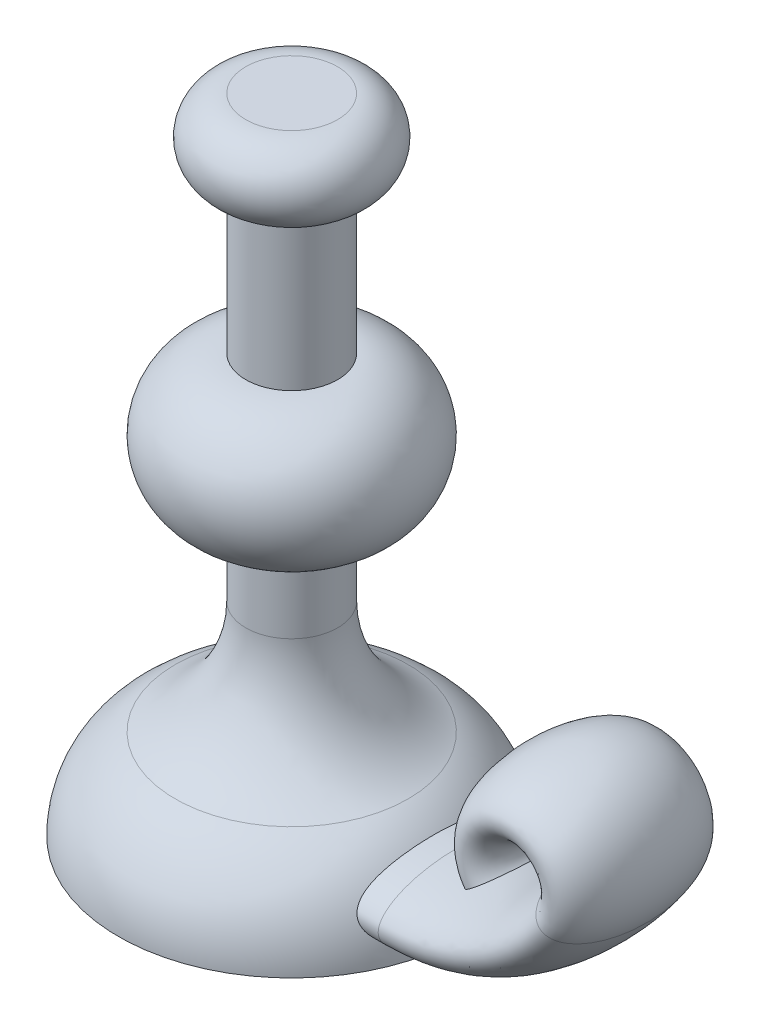
ISO-10303-21;
HEADER;
FILE_DESCRIPTION(('STEP AP214'),'2;1');
FILE_NAME('part.step','',(''),(''),'','','');
FILE_SCHEMA(('AUTOMOTIVE_DESIGN { 1 0 10303 214 1 1 1 1 }'));
ENDSEC;
DATA;
#1=APPLICATION_CONTEXT('core data for automotive mechanical design processes');
#2=APPLICATION_PROTOCOL_DEFINITION('international standard','automotive_design',2000,#1);
#3=PRODUCT_CONTEXT('',#1,'mechanical');
#4=PRODUCT('Part','Part','',(#3));
#5=PRODUCT_RELATED_PRODUCT_CATEGORY('part','',(#4));
#6=PRODUCT_DEFINITION_FORMATION('','',#4);
#7=PRODUCT_DEFINITION_CONTEXT('part definition',#1,'design');
#8=PRODUCT_DEFINITION('design','',#6,#7);
#9=PRODUCT_DEFINITION_SHAPE('','',#8);
#10=(LENGTH_UNIT() NAMED_UNIT(*) SI_UNIT(.MILLI.,.METRE.));
#11=(NAMED_UNIT(*) PLANE_ANGLE_UNIT() SI_UNIT($,.RADIAN.));
#12=(NAMED_UNIT(*) SI_UNIT($,.STERADIAN.) SOLID_ANGLE_UNIT());
#13=UNCERTAINTY_MEASURE_WITH_UNIT(LENGTH_MEASURE(1.E-05),#10,'distance_accuracy_value','');
#14=(GEOMETRIC_REPRESENTATION_CONTEXT(3) GLOBAL_UNCERTAINTY_ASSIGNED_CONTEXT((#13)) GLOBAL_UNIT_ASSIGNED_CONTEXT((#10,
#11,#12)) REPRESENTATION_CONTEXT('',''));
#15=CARTESIAN_POINT('',(0.,0.,0.));
#16=DIRECTION('',(0.,0.,1.));
#17=DIRECTION('',(1.,0.,0.));
#18=AXIS2_PLACEMENT_3D('',#15,#16,#17);
#19=CARTESIAN_POINT('',(0.,118.049892275042,0.));
#20=DIRECTION('',(0.,-1.,0.));
#21=DIRECTION('',(1.,0.,0.));
#22=AXIS2_PLACEMENT_3D('',#19,#20,#21);
#23=PLANE('',#22);
#24=CARTESIAN_POINT('',(0.,118.049892275042,0.));
#25=DIRECTION('',(0.,1.,0.));
#26=DIRECTION('',(-1.,0.,0.));
#27=AXIS2_PLACEMENT_3D('',#24,#25,#26);
#28=CIRCLE('',#27,15.9016263608618);
#29=CARTESIAN_POINT('',(-15.9016263608618,118.049892275042,0.));
#30=VERTEX_POINT('',#29);
#31=EDGE_CURVE('E102',#30,#30,#28,.T.);
#32=ORIENTED_EDGE('',*,*,#31,.T.);
#33=EDGE_LOOP('',(#32));
#34=FACE_BOUND('',#33,.T.);
#35=ADVANCED_FACE('F39',(#34),#23,.F.);
#36=CARTESIAN_POINT('',(0.,104.986323550333,0.));
#37=DIRECTION('',(0.,1.,0.));
#38=DIRECTION('',(-1.,0.,0.));
#39=AXIS2_PLACEMENT_3D('',#36,#37,#38);
#40=TOROIDAL_SURFACE('',#39,15.9016263608618,13.0635687247096);
#41=ORIENTED_EDGE('',*,*,#31,.F.);
#42=EDGE_LOOP('',(#41));
#43=FACE_BOUND('',#42,.T.);
#44=CARTESIAN_POINT('',(0.,91.9227548256233,0.));
#45=DIRECTION('',(0.,1.,0.));
#46=DIRECTION('',(-1.,0.,0.));
#47=AXIS2_PLACEMENT_3D('',#44,#45,#46);
#48=CIRCLE('',#47,15.9016263608618);
#49=CARTESIAN_POINT('',(-15.9016263608618,91.9227548256233,0.));
#50=VERTEX_POINT('',#49);
#51=EDGE_CURVE('E98',#50,#50,#48,.T.);
#52=ORIENTED_EDGE('',*,*,#51,.T.);
#53=EDGE_LOOP('',(#52));
#54=FACE_BOUND('',#53,.T.);
#55=ADVANCED_FACE('F154',(#43,#54),#40,.T.);
#56=CARTESIAN_POINT('',(0.,118.049892275042,0.));
#57=DIRECTION('',(0.,1.,0.));
#58=DIRECTION('',(-1.,0.,0.));
#59=AXIS2_PLACEMENT_3D('',#56,#57,#58);
#60=CYLINDRICAL_SURFACE('',#59,15.9016263608618);
#61=ORIENTED_EDGE('',*,*,#51,.F.);
#62=EDGE_LOOP('',(#61));
#63=FACE_BOUND('',#62,.T.);
#64=CARTESIAN_POINT('',(0.,40.0444099620285,0.));
#65=DIRECTION('',(0.,1.,0.));
#66=DIRECTION('',(-1.,0.,0.));
#67=AXIS2_PLACEMENT_3D('',#64,#65,#66);
#68=CIRCLE('',#67,15.9016263608618);
#69=CARTESIAN_POINT('',(-15.9016263608618,40.0444099620285,0.));
#70=VERTEX_POINT('',#69);
#71=EDGE_CURVE('E94',#70,#70,#68,.T.);
#72=ORIENTED_EDGE('',*,*,#71,.T.);
#73=EDGE_LOOP('',(#72));
#74=FACE_BOUND('',#73,.T.);
#75=ADVANCED_FACE('F159',(#63,#74),#60,.T.);
#76=CARTESIAN_POINT('',(0.,15.6089576712049,0.));
#77=DIRECTION('',(0.,1.,0.));
#78=DIRECTION('',(-1.,0.,0.));
#79=AXIS2_PLACEMENT_3D('',#76,#77,#78);
#80=DEGENERATE_TOROIDAL_SURFACE('',#79,15.9016263608618,24.4354522908236,.T.);
#81=ORIENTED_EDGE('',*,*,#71,.F.);
#82=EDGE_LOOP('',(#81));
#83=FACE_BOUND('',#82,.T.);
#84=CARTESIAN_POINT('',(0.,-8.82649461961876,0.));
#85=DIRECTION('',(0.,1.,0.));
#86=DIRECTION('',(-1.,0.,0.));
#87=AXIS2_PLACEMENT_3D('',#84,#85,#86);
#88=CIRCLE('',#87,15.9016263608618);
#89=CARTESIAN_POINT('',(-15.9016263608618,-8.82649461961876,0.));
#90=VERTEX_POINT('',#89);
#91=EDGE_CURVE('E90',#90,#90,#88,.T.);
#92=ORIENTED_EDGE('',*,*,#91,.T.);
#93=EDGE_LOOP('',(#92));
#94=FACE_BOUND('',#93,.T.);
#95=ADVANCED_FACE('F167',(#83,#94),#80,.T.);
#96=CARTESIAN_POINT('',(0.,118.049892275042,0.));
#97=DIRECTION('',(0.,1.,0.));
#98=DIRECTION('',(-1.,0.,0.));
#99=AXIS2_PLACEMENT_3D('',#96,#97,#98);
#100=CYLINDRICAL_SURFACE('',#99,15.9016263608618);
#101=ORIENTED_EDGE('',*,*,#91,.F.);
#102=EDGE_LOOP('',(#101));
#103=FACE_BOUND('',#102,.T.);
#104=CARTESIAN_POINT('',(0.,-34.3897370161727,0.));
#105=DIRECTION('',(0.,1.,0.));
#106=DIRECTION('',(-1.,0.,0.));
#107=AXIS2_PLACEMENT_3D('',#104,#105,#106);
#108=CIRCLE('',#107,15.9016263608618);
#109=CARTESIAN_POINT('',(-15.9016263608618,-34.3897370161727,0.));
#110=VERTEX_POINT('',#109);
#111=EDGE_CURVE('E86',#110,#110,#108,.T.);
#112=ORIENTED_EDGE('',*,*,#111,.T.);
#113=EDGE_LOOP('',(#112));
#114=FACE_BOUND('',#113,.T.);
#115=ADVANCED_FACE('F173',(#103,#114),#100,.T.);
#116=CARTESIAN_POINT('',(0.,-34.3897370161727,0.));
#117=DIRECTION('',(0.,1.,0.));
#118=DIRECTION('',(-1.,0.,0.));
#119=AXIS2_PLACEMENT_3D('',#116,#117,#118);
#120=TOROIDAL_SURFACE('',#119,59.3967314385279,43.4951050776661);
#121=ORIENTED_EDGE('',*,*,#111,.F.);
#122=EDGE_LOOP('',(#121));
#123=FACE_BOUND('',#122,.T.);
#124=CARTESIAN_POINT('',(0.,-73.4864606814905,0.));
#125=DIRECTION('',(0.,1.,0.));
#126=DIRECTION('',(-1.,0.,0.));
#127=AXIS2_PLACEMENT_3D('',#124,#125,#126);
#128=CIRCLE('',#127,40.3370786516854);
#129=CARTESIAN_POINT('',(-40.3370786516854,-73.4864606814905,0.));
#130=VERTEX_POINT('',#129);
#131=EDGE_CURVE('E77',#130,#130,#128,.T.);
#132=ORIENTED_EDGE('',*,*,#131,.T.);
#133=EDGE_LOOP('',(#132));
#134=FACE_BOUND('',#133,.T.);
#135=ADVANCED_FACE('F150',(#123,#134),#120,.F.);
#136=CARTESIAN_POINT('',(0.,-104.947134838794,0.));
#137=DIRECTION('',(0.,1.,0.));
#138=DIRECTION('',(-1.,0.,0.));
#139=AXIS2_PLACEMENT_3D('',#136,#137,#138);
#140=DEGENERATE_TOROIDAL_SURFACE('',#139,25.,35.,.T.);
#141=CARTESIAN_POINT('',(57.280323618614,-100.587542830694,-16.9212785912257));
#142=CARTESIAN_POINT('',(57.4095420193036,-100.715893083628,-16.5407243452581));
#143=CARTESIAN_POINT('',(57.5340602918932,-100.83816482621,-16.156561430771));
#144=CARTESIAN_POINT('',(57.7735781713212,-101.071075187336,-15.3822294193053));
#145=CARTESIAN_POINT('',(57.8885868330789,-101.1817249,-14.9920664653903));
#146=CARTESIAN_POINT('',(58.1091665602166,-101.392112728431,-14.2063853685104));
#147=CARTESIAN_POINT('',(58.2147418378883,-101.491855718877,-13.8108697074582));
#148=CARTESIAN_POINT('',(58.4165057646457,-101.681000365338,-13.0150577659181));
#149=CARTESIAN_POINT('',(58.5126954919977,-101.770403209507,-12.6147620405364));
#150=CARTESIAN_POINT('',(58.6958277590643,-101.939448564592,-11.8094519689861));
#151=CARTESIAN_POINT('',(58.7827581271076,-102.019078248857,-11.4044321698485));
#152=CARTESIAN_POINT('',(58.9472544410022,-102.168851333133,-10.5906640020539));
#153=CARTESIAN_POINT('',(59.0248183572762,-102.238992677551,-10.1819148458619));
#154=CARTESIAN_POINT('',(59.1705848589183,-102.370120285665,-9.3611965468722));
#155=CARTESIAN_POINT('',(59.2387853568028,-102.431104508152,-8.94922670762133));
#156=CARTESIAN_POINT('',(59.3658216191179,-102.544191222758,-8.12257565002574));
#157=CARTESIAN_POINT('',(59.4246559378303,-102.596292343813,-7.70789402336701));
#158=CARTESIAN_POINT('',(59.5559347719606,-102.712116796032,-6.69986788814688));
#159=CARTESIAN_POINT('',(59.6235617303308,-102.771391288556,-6.10537392650416));
#160=CARTESIAN_POINT('',(59.7398290963376,-102.872930883531,-4.91304240586663));
#161=CARTESIAN_POINT('',(59.7884674938188,-102.915194185169,-4.31520449966856));
#162=CARTESIAN_POINT('',(59.8667678007391,-102.983082299947,-3.11727226568321));
#163=CARTESIAN_POINT('',(59.8964273942492,-103.008705082499,-2.51717767150255));
#164=CARTESIAN_POINT('',(59.9367696050764,-103.043529134199,-1.31583255093188));
#165=CARTESIAN_POINT('',(59.9474507826533,-103.052729157484,-0.714581940307586));
#166=CARTESIAN_POINT('',(59.9498349531557,-103.054783968725,0.488030564341453));
#167=CARTESIAN_POINT('',(59.9415364996351,-103.047637510908,1.08939246335512));
#168=CARTESIAN_POINT('',(59.9059574062503,-103.016935881367,2.29108913487829));
#169=CARTESIAN_POINT('',(59.878678298775,-102.99338203428,2.89142398638367));
#170=CARTESIAN_POINT('',(59.8051369240014,-102.929665109223,4.08997748783085));
#171=CARTESIAN_POINT('',(59.758876824401,-102.889503927866,4.68819637155776));
#172=CARTESIAN_POINT('',(59.6473639478194,-102.792220560515,5.8814416168783));
#173=CARTESIAN_POINT('',(59.5821128690141,-102.73509989103,6.4764682590796));
#174=CARTESIAN_POINT('',(59.4537081507745,-102.621974133724,7.49480001349323));
#175=CARTESIAN_POINT('',(59.3951616462036,-102.570205506455,7.91916641151266));
#176=CARTESIAN_POINT('',(59.2682779545054,-102.457423545153,8.76514178130622));
#177=CARTESIAN_POINT('',(59.1999422323622,-102.396411594332,9.18675115582246));
#178=CARTESIAN_POINT('',(59.0534823044724,-102.264856796701,10.0266728351416));
#179=CARTESIAN_POINT('',(58.9753603023835,-102.19431609528,10.4449858597417));
#180=CARTESIAN_POINT('',(58.8093249611009,-102.043357206147,11.2777750733292));
#181=CARTESIAN_POINT('',(58.7214138046551,-101.962941219979,11.6922520954179));
#182=CARTESIAN_POINT('',(58.5359039605065,-101.791922503912,12.5163016580575));
#183=CARTESIAN_POINT('',(58.4383186625987,-101.70133383139,12.9258801219182));
#184=CARTESIAN_POINT('',(58.2333412637973,-101.509386222586,13.7400880253632));
#185=CARTESIAN_POINT('',(58.1259480291835,-101.408026040981,14.1447168866671));
#186=CARTESIAN_POINT('',(57.9013073463364,-101.193939402136,14.9484200602704));
#187=CARTESIAN_POINT('',(57.7840553751983,-101.081207723192,15.3474917241468));
#188=CARTESIAN_POINT('',(57.5396208778272,-100.843623500785,16.1393960946722));
#189=CARTESIAN_POINT('',(57.4124285488468,-100.71875896214,16.5322221709527));
#190=CARTESIAN_POINT('',(57.280323618614,-100.587542830694,16.9212785912257));
#191=B_SPLINE_CURVE_WITH_KNOTS('',3,(#141,#142,#143,#144,#145,#146,#147,#148,#149,#150,#151,
#152,#153,#154,#155,#156,#157,#158,#159,#160,#161,#162,#163,#164,#165,#166,#167,#168,#169,#170,
#171,#172,#173,#174,#175,#176,#177,#178,#179,#180,#181,#182,#183,#184,#185,#186,#187,#188,#189,
#190),.UNSPECIFIED.,.F.,.F.,(4,2,2,2,2,2,2,2,2,2,2,2,2,2,2,2,2,2,2,2,2,2,2,2,4),(0.,
1.26554086416353,2.529862478007,3.7936166827701,5.05722552879229,6.32247543866653,
7.58799902014847,8.85380428130475,10.119804736984,11.9229828608009,13.726351819827,
15.5299407968414,17.3336665918342,19.13752985414,20.9412474997996,22.7447592117066,
24.548109702889,25.8424174930613,27.136531788359,28.430355199294,29.7238906940092,
31.0156601848824,32.3075791835761,33.6000941456973,34.8939002156783),.UNSPECIFIED.);
#192=CARTESIAN_POINT('',(57.280323618614,-100.587542830694,-16.9212785912257));
#193=VERTEX_POINT('',#192);
#194=CARTESIAN_POINT('',(57.280323618614,-100.587542830694,16.9212785912257));
#195=VERTEX_POINT('',#194);
#196=EDGE_CURVE('E53',#193,#195,#191,.T.);
#197=ORIENTED_EDGE('',*,*,#196,.T.);
#198=CARTESIAN_POINT('',(57.280323618614,-100.587542830694,16.9212785912257));
#199=CARTESIAN_POINT('',(57.16378035453,-100.471746148378,17.2644714075889));
#200=CARTESIAN_POINT('',(57.0434187791522,-100.35124221344,17.6048149244928));
#201=CARTESIAN_POINT('',(56.7943185441289,-100.099441374855,18.2810429674633));
#202=CARTESIAN_POINT('',(56.6655327687522,-99.9680824509814,18.6168870110382));
#203=CARTESIAN_POINT('',(56.3998101690406,-99.694120096265,19.282281378593));
#204=CARTESIAN_POINT('',(56.262845946609,-99.5514782818946,19.6118050255196));
#205=CARTESIAN_POINT('',(55.9810489779608,-99.2543986989284,20.2626789827856));
#206=CARTESIAN_POINT('',(55.8362060821981,-99.0999456055634,20.5840179280613));
#207=CARTESIAN_POINT('',(55.5364777095257,-98.775884507743,21.2219291278778));
#208=CARTESIAN_POINT('',(55.3814670798336,-98.6060706251427,21.5383384748285));
#209=CARTESIAN_POINT('',(55.0639494469001,-98.2526175280276,22.1587626485207));
#210=CARTESIAN_POINT('',(54.9014538317556,-98.0689990639823,22.4627950597142));
#211=CARTESIAN_POINT('',(54.5693013362075,-97.6867291450732,23.056257445689));
#212=CARTESIAN_POINT('',(54.3996583834406,-97.4881063789225,23.345713608105));
#213=CARTESIAN_POINT('',(54.0534860447761,-97.0741540711004,23.9075811804583));
#214=CARTESIAN_POINT('',(53.8769650652102,-96.8588446239969,24.1800123992289));
#215=CARTESIAN_POINT('',(53.5890878316666,-96.4989728178396,24.6000562451684));
#216=CARTESIAN_POINT('',(53.4797629666358,-96.360366101842,24.7541859776529));
#217=CARTESIAN_POINT('',(53.2589856285834,-96.0759021107355,25.0540623231003));
#218=CARTESIAN_POINT('',(53.1475330300455,-95.9300444070675,25.199808439461));
#219=CARTESIAN_POINT('',(52.9229082507878,-95.630790834497,25.4815489924739));
#220=CARTESIAN_POINT('',(52.8097379891214,-95.4774030037878,25.6175534623162));
#221=CARTESIAN_POINT('',(52.5819452421552,-95.1624958797747,25.8785324253428));
#222=CARTESIAN_POINT('',(52.4673227671008,-95.000976643814,26.0035069962936));
#223=CARTESIAN_POINT('',(52.2358432652276,-94.6675269836896,26.2420373111996));
#224=CARTESIAN_POINT('',(52.118975628393,-94.4954994566142,26.3554478939562));
#225=CARTESIAN_POINT('',(51.8850063428344,-94.1424013465885,26.5671026128516));
#226=CARTESIAN_POINT('',(51.7679046694852,-93.9613297580916,26.66534505756));
#227=CARTESIAN_POINT('',(51.534676852332,-93.5904468097014,26.8440188731608));
#228=CARTESIAN_POINT('',(51.4185493660195,-93.4006511990208,26.9244809263199));
#229=CARTESIAN_POINT('',(51.1883896296162,-93.0124449268716,27.0650390294836));
#230=CARTESIAN_POINT('',(51.0743564159763,-92.8140383760669,27.125144679107));
#231=CARTESIAN_POINT('',(50.8825759796146,-92.4683326797826,27.2081064405701));
#232=CARTESIAN_POINT('',(50.8039035539394,-92.3229145336198,27.2367106321163));
#233=CARTESIAN_POINT('',(50.6490955494205,-92.0288470627546,27.2813190006799));
#234=CARTESIAN_POINT('',(50.572959283385,-91.8801986316603,27.2973266178731));
#235=CARTESIAN_POINT('',(50.4239707152842,-91.5805655074524,27.315951992308));
#236=CARTESIAN_POINT('',(50.3511159014112,-91.4295827243327,27.3185801697026));
#237=CARTESIAN_POINT('',(50.2093221815663,-91.1261653926089,27.3099346836091));
#238=CARTESIAN_POINT('',(50.1403833400554,-90.973730820155,27.2986607913474));
#239=CARTESIAN_POINT('',(50.0068447574882,-90.6680746538161,27.2619409734947));
#240=CARTESIAN_POINT('',(49.9422595798381,-90.5148521013069,27.2364498944011));
#241=CARTESIAN_POINT('',(49.818187635019,-90.2093314456746,27.1714346889772));
#242=CARTESIAN_POINT('',(49.7587007564191,-90.0570333224144,27.1319108694503));
#243=CARTESIAN_POINT('',(49.6451363130129,-89.7544537199159,27.0393482917262));
#244=CARTESIAN_POINT('',(49.5910616025052,-89.6041733406023,26.9863024539732));
#245=CARTESIAN_POINT('',(49.488502522406,-89.3067418827226,26.8675640601675));
#246=CARTESIAN_POINT('',(49.4400188074501,-89.1595911722431,26.8018700255686));
#247=CARTESIAN_POINT('',(49.3388164666272,-88.8381471044139,26.643574825776));
#248=CARTESIAN_POINT('',(49.2874146305426,-88.6647899954457,26.5482242581333));
#249=CARTESIAN_POINT('',(49.1924500803025,-88.3249904953869,26.3425753411758));
#250=CARTESIAN_POINT('',(49.1488891638879,-88.1585496967568,26.2322735740344));
#251=CARTESIAN_POINT('',(49.0289784662521,-87.670036076276,25.8817777621795));
#252=CARTESIAN_POINT('',(48.9634987193385,-87.359091756136,25.622156915267));
#253=CARTESIAN_POINT('',(48.8663378540495,-86.8256328727179,25.1204871042849));
#254=CARTESIAN_POINT('',(48.8305653132082,-86.597661364008,24.8847892455539));
#255=CARTESIAN_POINT('',(48.7711328384289,-86.1602590542009,24.3951274411785));
#256=CARTESIAN_POINT('',(48.7474810828701,-85.9508408503617,24.1411512938734));
#257=CARTESIAN_POINT('',(48.7097614163154,-85.5487959065174,23.6188320656433));
#258=CARTESIAN_POINT('',(48.695714516283,-85.356206777706,23.3504588638879));
#259=CARTESIAN_POINT('',(48.6751855154243,-84.9867084814798,22.8030000533951));
#260=CARTESIAN_POINT('',(48.6687020861036,-84.8097965654687,22.5239163348163));
#261=CARTESIAN_POINT('',(48.6602122206419,-84.4042134038712,21.8473973857596));
#262=CARTESIAN_POINT('',(48.6609159507305,-84.1820660558923,21.4460257108012));
#263=CARTESIAN_POINT('',(48.6701195040885,-83.7613001107385,20.630928886207));
#264=CARTESIAN_POINT('',(48.6786261299237,-83.5627022146087,20.2171932622013));
#265=CARTESIAN_POINT('',(48.7009054017568,-83.186344436903,19.3803611845363));
#266=CARTESIAN_POINT('',(48.7146799994507,-83.0085923102673,18.9572613163792));
#267=CARTESIAN_POINT('',(48.7456284358764,-82.6713454680053,18.1028534674599));
#268=CARTESIAN_POINT('',(48.7628102571797,-82.5118950422893,17.6715284030218));
#269=CARTESIAN_POINT('',(48.7991026405051,-82.2099822038028,16.8033217167411));
#270=CARTESIAN_POINT('',(48.818212238329,-82.0675113755257,16.3664429672633));
#271=CARTESIAN_POINT('',(48.8572726076242,-81.7979992222673,15.4880190062391));
#272=CARTESIAN_POINT('',(48.87722336238,-81.6709575908697,15.0464738875538));
#273=CARTESIAN_POINT('',(48.9184182791557,-81.4233404615576,14.1308150597838));
#274=CARTESIAN_POINT('',(48.9396625024633,-81.3037170223938,13.6564445420996));
#275=CARTESIAN_POINT('',(48.9813758784066,-81.0794436458909,12.704117435856));
#276=CARTESIAN_POINT('',(49.0018449695641,-80.9747948944203,12.2261605664386));
#277=CARTESIAN_POINT('',(49.0414297598824,-80.7794804212187,11.266984935741));
#278=CARTESIAN_POINT('',(49.0605444554082,-80.6888250114143,10.7857640391828));
#279=CARTESIAN_POINT('',(49.0969527827183,-80.5208362798022,9.82091490795287));
#280=CARTESIAN_POINT('',(49.1142463173824,-80.4435036683421,9.33728654633316));
#281=CARTESIAN_POINT('',(49.146672515492,-80.3015405539226,8.36792586868382));
#282=CARTESIAN_POINT('',(49.1618044215392,-80.236914500156,7.88219287634764));
#283=CARTESIAN_POINT('',(49.1896440839078,-80.1199266913386,6.90917677751516));
#284=CARTESIAN_POINT('',(49.2023517385967,-80.0675654504476,6.42189360690066));
#285=CARTESIAN_POINT('',(49.2365497552664,-79.9282407215045,4.95759664804084));
#286=CARTESIAN_POINT('',(49.2540945823839,-79.8591230186027,3.97873571040566));
#287=CARTESIAN_POINT('',(49.2777232266042,-79.7666096372096,2.01926338101806));
#288=CARTESIAN_POINT('',(49.2838125467958,-79.7431920047483,1.0386530563877));
#289=CARTESIAN_POINT('',(49.2842703472045,-79.7414093256221,-0.922383111951493));
#290=CARTESIAN_POINT('',(49.278641921474,-79.7630323860335,-1.90280893601368));
#291=CARTESIAN_POINT('',(49.2579834841818,-79.8438823365395,-3.68513024871743));
#292=CARTESIAN_POINT('',(49.2448281748287,-79.8956397286493,-4.48739454986687));
#293=CARTESIAN_POINT('',(49.2112768303697,-80.0307621326586,-6.0892015915856));
#294=CARTESIAN_POINT('',(49.19088020163,-80.1141297359596,-6.88874410359928));
#295=CARTESIAN_POINT('',(49.14364810105,-80.3140789648813,-8.48383543292356));
#296=CARTESIAN_POINT('',(49.1168098633132,-80.4306748620989,-9.2793823844063));
#297=CARTESIAN_POINT('',(49.0580065734264,-80.6994453593616,-10.8644115083749));
#298=CARTESIAN_POINT('',(49.0260410965158,-80.8516229076083,-11.6538931727053));
#299=CARTESIAN_POINT('',(48.9758463297084,-81.1091202432919,-12.831460397646));
#300=CARTESIAN_POINT('',(48.9587424117594,-81.1998124135422,-13.2228289657616));
#301=CARTESIAN_POINT('',(48.9241619268274,-81.3915241804197,-14.0030049600581));
#302=CARTESIAN_POINT('',(48.9066853787415,-81.4925432543201,-14.391812514813));
#303=CARTESIAN_POINT('',(48.8718239877635,-81.7055021729741,-15.1661386318602));
#304=CARTESIAN_POINT('',(48.854439088663,-81.8174342283193,-15.5516593295631));
#305=CARTESIAN_POINT('',(48.8203214468265,-82.0530766297539,-16.3190936542054));
#306=CARTESIAN_POINT('',(48.803588655572,-82.1767860972065,-16.7010075478922));
#307=CARTESIAN_POINT('',(48.7714258972484,-82.4375015351488,-17.4621255263743));
#308=CARTESIAN_POINT('',(48.7560016589387,-82.5745608435481,-17.8413116496929));
#309=CARTESIAN_POINT('',(48.7274579817764,-82.8627374673672,-18.5944486279976));
#310=CARTESIAN_POINT('',(48.7143387189518,-83.0138558551145,-18.968399081137));
#311=CARTESIAN_POINT('',(48.6915826265982,-83.3316904089951,-19.7100548087161));
#312=CARTESIAN_POINT('',(48.6819481726479,-83.4984171181511,-20.0777556607066));
#313=CARTESIAN_POINT('',(48.6677485640211,-83.8481103689676,-20.8028492358466));
#314=CARTESIAN_POINT('',(48.6631539771952,-84.03097581099,-21.1602898067483));
#315=CARTESIAN_POINT('',(48.6608962714611,-84.4157509222743,-21.864610242025));
#316=CARTESIAN_POINT('',(48.6632294960921,-84.6176504909629,-22.2114955797559));
#317=CARTESIAN_POINT('',(48.6773713491258,-85.0428365756161,-22.8913141244411));
#318=CARTESIAN_POINT('',(48.6891681748745,-85.2660961468957,-23.2242641670986));
#319=CARTESIAN_POINT('',(48.7171332046194,-85.6276485659391,-23.7214749272991));
#320=CARTESIAN_POINT('',(48.7287316782883,-85.7572863027121,-23.8923100111746));
#321=CARTESIAN_POINT('',(48.756251667266,-86.0240158108217,-24.2277227643072));
#322=CARTESIAN_POINT('',(48.7721730018469,-86.1611072703453,-24.3923006948322));
#323=CARTESIAN_POINT('',(48.8090679418025,-86.4433490917883,-24.7142067838655));
#324=CARTESIAN_POINT('',(48.8300479205709,-86.5885094407648,-24.8715254961979));
#325=CARTESIAN_POINT('',(48.8778412031797,-86.8871028663386,-25.1772246934683));
#326=CARTESIAN_POINT('',(48.9046546326668,-87.0405361210724,-25.325604985794));
#327=CARTESIAN_POINT('',(48.9653371905219,-87.3578658948057,-25.6134300668856));
#328=CARTESIAN_POINT('',(48.9992899407251,-87.5218688308162,-25.7527407387339));
#329=CARTESIAN_POINT('',(49.0749378208163,-87.8585895857557,-26.0182151171756));
#330=CARTESIAN_POINT('',(49.1166333961355,-88.0313079056487,-26.1443780667514));
#331=CARTESIAN_POINT('',(49.2084715018321,-88.3846265427569,-26.3808112538308));
#332=CARTESIAN_POINT('',(49.2585940934425,-88.5652075260819,-26.4911178913311));
#333=CARTESIAN_POINT('',(49.3679510624709,-88.9336445630327,-26.6935695641595));
#334=CARTESIAN_POINT('',(49.4271816568292,-89.1214975720525,-26.7857221038075));
#335=CARTESIAN_POINT('',(49.5389301591482,-89.45499815685,-26.9288944489888));
#336=CARTESIAN_POINT('',(49.5894007853448,-89.5994030577886,-26.9844327395313));
#337=CARTESIAN_POINT('',(49.6954991801407,-89.8905277480736,-27.0831346666694));
#338=CARTESIAN_POINT('',(49.751126168663,-90.037247184489,-27.1263001710441));
#339=CARTESIAN_POINT('',(49.867278324152,-90.3319401082446,-27.1996418698184));
#340=CARTESIAN_POINT('',(49.9278020812488,-90.4799132237198,-27.2298217873078));
#341=CARTESIAN_POINT('',(50.0533576726037,-90.7760638135117,-27.2769193245248));
#342=CARTESIAN_POINT('',(50.1183896889369,-90.924241295845,-27.293836408266));
#343=CARTESIAN_POINT('',(50.2523004696899,-91.2194387822647,-27.3144308475965));
#344=CARTESIAN_POINT('',(50.3211719966579,-91.3664604053067,-27.3181323110853));
#345=CARTESIAN_POINT('',(50.4622537835843,-91.6586346306397,-27.3127224719855));
#346=CARTESIAN_POINT('',(50.5344639825543,-91.8037872670101,-27.3036114033574));
#347=CARTESIAN_POINT('',(50.6816265024879,-92.0914888715919,-27.2731817225681));
#348=CARTESIAN_POINT('',(50.7565803932147,-92.234036277067,-27.2518560164683));
#349=CARTESIAN_POINT('',(50.9085770101039,-92.5158266556514,-27.1977828366012));
#350=CARTESIAN_POINT('',(50.9856202767594,-92.6550687559126,-27.1650323809061));
#351=CARTESIAN_POINT('',(51.1738634659538,-92.9874239221706,-27.0730310598238));
#352=CARTESIAN_POINT('',(51.2858344451018,-93.1786328924923,-27.0084266920831));
#353=CARTESIAN_POINT('',(51.5113771271549,-93.5526726738786,-26.8606035832333));
#354=CARTESIAN_POINT('',(51.6249494524181,-93.7355001031762,-26.7773774069075));
#355=CARTESIAN_POINT('',(51.9667137914064,-94.271615805567,-26.5032391067629));
#356=CARTESIAN_POINT('',(52.1957232962906,-94.6121387992836,-26.2879873623326));
#357=CARTESIAN_POINT('',(52.5452216325377,-95.1112064315151,-25.919432732191));
#358=CARTESIAN_POINT('',(52.667368274254,-95.281659082182,-25.782918294668));
#359=CARTESIAN_POINT('',(52.9099809283725,-95.613567187611,-25.497650799318));
#360=CARTESIAN_POINT('',(53.0304459817998,-95.7750176540973,-25.3488910670029));
#361=CARTESIAN_POINT('',(53.2691703322957,-96.0893332265667,-25.0408954996629));
#362=CARTESIAN_POINT('',(53.387429147181,-96.2421964701202,-24.8816574081881));
#363=CARTESIAN_POINT('',(53.6220394917286,-96.5406566700386,-24.5532335257647));
#364=CARTESIAN_POINT('',(53.7383778029621,-96.6862114182061,-24.3840000413075));
#365=CARTESIAN_POINT('',(53.9682487218577,-96.9696774064109,-24.0375520461232));
#366=CARTESIAN_POINT('',(54.0817821652848,-97.1075909388969,-23.8603399583025));
#367=CARTESIAN_POINT('',(54.3059154049495,-97.3763065192375,-23.4988465193586));
#368=CARTESIAN_POINT('',(54.4165153355066,-97.5071088929862,-23.3145654928556));
#369=CARTESIAN_POINT('',(54.6612936697583,-97.7931679686963,-22.8939781231471));
#370=CARTESIAN_POINT('',(54.794640448652,-97.9466039538253,-22.6559490760587));
#371=CARTESIAN_POINT('',(55.0565119466257,-98.2439850052983,-22.1713495718997));
#372=CARTESIAN_POINT('',(55.1850349642356,-98.3879267360745,-21.9247761589));
#373=CARTESIAN_POINT('',(55.437187283173,-98.6670121272432,-21.4240335225392));
#374=CARTESIAN_POINT('',(55.5608135122708,-98.8021502975377,-21.1698597008325));
#375=CARTESIAN_POINT('',(55.80307978205,-99.0641736123076,-20.6547837362204));
#376=CARTESIAN_POINT('',(55.9217172136563,-99.1910544568483,-20.3938781850224));
#377=CARTESIAN_POINT('',(56.1513085100005,-99.4342511228217,-19.872052188535));
#378=CARTESIAN_POINT('',(56.2623745808916,-99.5507391606155,-19.6112611412587));
#379=CARTESIAN_POINT('',(56.4795517366584,-99.7765848633456,-19.0847424946344));
#380=CARTESIAN_POINT('',(56.5856650221462,-99.8859457037514,-18.8190171624723));
#381=CARTESIAN_POINT('',(56.7928393409804,-100.09781677734,-18.2833499314338));
#382=CARTESIAN_POINT('',(56.8939065573146,-100.200335448901,-18.0134137526112));
#383=CARTESIAN_POINT('',(57.0909016407195,-100.398753120195,-17.4700199719211));
#384=CARTESIAN_POINT('',(57.1868403822487,-100.49466626199,-17.1965714809619));
#385=CARTESIAN_POINT('',(57.280323618614,-100.587542830694,-16.9212785912257));
#386=B_SPLINE_CURVE_WITH_KNOTS('',3,(#198,#199,#200,#201,#202,#203,#204,#205,#206,#207,#208,
#209,#210,#211,#212,#213,#214,#215,#216,#217,#218,#219,#220,#221,#222,#223,#224,#225,#226,#227,
#228,#229,#230,#231,#232,#233,#234,#235,#236,#237,#238,#239,#240,#241,#242,#243,#244,#245,#246,
#247,#248,#249,#250,#251,#252,#253,#254,#255,#256,#257,#258,#259,#260,#261,#262,#263,#264,#265,
#266,#267,#268,#269,#270,#271,#272,#273,#274,#275,#276,#277,#278,#279,#280,#281,#282,#283,#284,
#285,#286,#287,#288,#289,#290,#291,#292,#293,#294,#295,#296,#297,#298,#299,#300,#301,#302,#303,
#304,#305,#306,#307,#308,#309,#310,#311,#312,#313,#314,#315,#316,#317,#318,#319,#320,#321,#322,
#323,#324,#325,#326,#327,#328,#329,#330,#331,#332,#333,#334,#335,#336,#337,#338,#339,#340,#341,
#342,#343,#344,#345,#346,#347,#348,#349,#350,#351,#352,#353,#354,#355,#356,#357,#358,#359,#360,
#361,#362,#363,#364,#365,#366,#367,#368,#369,#370,#371,#372,#373,#374,#375,#376,#377,#378,#379,
#380,#381,#382,#383,#384,#385),.UNSPECIFIED.,.F.,.F.,(4,2,2,2,2,2,2,2,2,2,2,2,2,2,2,2,2,2,2,2,2,
2,2,2,2,2,2,2,2,2,2,2,2,2,2,2,2,2,2,2,2,2,2,2,2,2,2,2,2,2,2,2,2,2,2,2,2,2,2,2,2,2,2,2,2,2,2,2,2,
2,2,2,2,2,2,2,2,2,2,2,2,2,2,2,2,2,2,2,2,2,2,2,2,4),(0.,1.14145837318386,2.28996139194762,
3.44255507267376,4.59667044439113,5.76958532364775,6.94077108240713,8.10977157240524,
9.27738556317437,9.98020674930783,10.6830695241642,11.3851976702768,12.0873208656245,
12.7973864545791,13.5075311673182,14.216440698304,14.9250154565997,15.4279247164224,
15.9306965819664,16.4330768195906,16.9354653245313,17.4394585666796,17.943440790502,
18.4476874219568,18.9519930345492,19.5643024663851,20.1767521082405,21.4027542758401,
22.3910748416399,23.3800613917725,24.3712045226635,25.3621735368588,26.7373311603588,
28.1136887870714,29.4905568261262,30.8706895872757,32.2501354506701,33.6295539144671,
35.0983346546568,36.5672316455483,38.0372059758364,39.5072586582845,40.9778251656099,
42.4484533103126,45.3915281924822,48.3331888952532,51.274072955638,53.6855835343002,
56.0972918510799,58.5100375649742,60.9229832635067,62.1291786986442,63.3353131088457,
64.5405928274593,65.7457826982793,66.956002403299,68.166314491145,69.3774500952873,
70.5814745407339,71.7848636216959,72.9867542091274,73.6308419289881,74.2749027253101,
74.919779254287,75.5646696746257,76.2175823718802,76.8705326416924,77.5219591949446,
78.1731159017703,78.6608158884844,79.1484422138467,79.6359286388545,80.1234347634693,
80.6100511250342,81.096658600961,81.5835489726248,82.0705665207758,82.7618810154494,
83.4534720286318,84.8380639731884,85.5884210863372,86.3391899364336,87.0901209924182,
87.8449814728674,88.5996142467731,89.3542124077552,90.2929348731098,91.2319853974712,
92.1716160370171,93.1117321296651,94.0309385606307,94.9497326059633,95.8673717327408,
96.7829808982049),.UNSPECIFIED.);
#387=EDGE_CURVE('E11',#195,#193,#386,.T.);
#388=ORIENTED_EDGE('',*,*,#387,.T.);
#389=EDGE_LOOP('',(#197,#388));
#390=FACE_BOUND('',#389,.T.);
#391=ORIENTED_EDGE('',*,*,#131,.F.);
#392=EDGE_LOOP('',(#391));
#393=FACE_BOUND('',#392,.T.);
#394=CARTESIAN_POINT('',(0.,-104.947134838794,0.));
#395=DIRECTION('',(0.,1.,0.));
#396=DIRECTION('',(-1.,0.,0.));
#397=AXIS2_PLACEMENT_3D('',#394,#395,#396);
#398=CIRCLE('',#397,60.);
#399=CARTESIAN_POINT('',(-60.,-104.947134838794,0.));
#400=VERTEX_POINT('',#399);
#401=EDGE_CURVE('E71',#400,#400,#398,.T.);
#402=ORIENTED_EDGE('',*,*,#401,.T.);
#403=EDGE_LOOP('',(#402));
#404=FACE_BOUND('',#403,.T.);
#405=ADVANCED_FACE('F111',(#390,#393,#404),#140,.T.);
#406=CARTESIAN_POINT('',(60.,-104.947134838794,0.));
#407=DIRECTION('',(0.,1.,0.));
#408=DIRECTION('',(-1.,0.,0.));
#409=AXIS2_PLACEMENT_3D('',#406,#407,#408);
#410=PLANE('',#409);
#411=ORIENTED_EDGE('',*,*,#401,.F.);
#412=EDGE_LOOP('',(#411));
#413=FACE_BOUND('',#412,.T.);
#414=ADVANCED_FACE('F142',(#413),#410,.F.);
#415=CARTESIAN_POINT('',(0.,-91.4200986860532,-27.3162833986842));
#416=CARTESIAN_POINT('',(57.280323618614,-91.4200986860532,-27.3162833986842));
#417=CARTESIAN_POINT('',(0.,-68.0644497517481,-27.3162833986842));
#418=CARTESIAN_POINT('',(57.280323618614,-68.0644497517481,-27.3162833986842));
#419=CARTESIAN_POINT('',(0.,-68.0644497517481,27.3162833986842));
#420=CARTESIAN_POINT('',(57.280323618614,-68.0644497517481,27.3162833986842));
#421=CARTESIAN_POINT('',(0.,-91.4200986860532,27.3162833986842));
#422=CARTESIAN_POINT('',(57.280323618614,-91.4200986860532,27.3162833986842));
#423=CARTESIAN_POINT('',(0.,-114.775747620358,27.3162833986842));
#424=CARTESIAN_POINT('',(57.280323618614,-114.775747620358,27.3162833986842));
#425=CARTESIAN_POINT('',(0.,-114.775747620358,-27.3162833986842));
#426=CARTESIAN_POINT('',(57.280323618614,-114.775747620358,-27.3162833986842));
#427=CARTESIAN_POINT('',(0.,-91.4200986860532,-27.3162833986842));
#428=CARTESIAN_POINT('',(57.280323618614,-91.4200986860532,-27.3162833986842));
#429=(BOUNDED_SURFACE() B_SPLINE_SURFACE(3,1,((#415,#416),(#417,#418),(#419,#420),(#421,#422),
(#423,#424),(#425,#426),(#427,#428)),.UNSPECIFIED.,.T.,.F.,.F.) B_SPLINE_SURFACE_WITH_KNOTS((4,
3,4),(2,2),(0.,0.5,1.),(0.,1.),
.UNSPECIFIED.) GEOMETRIC_REPRESENTATION_ITEM() RATIONAL_B_SPLINE_SURFACE(((1.,1.),
(0.333333333333333,0.333333333333333),(0.333333333333333,0.333333333333333),(1.,1.),
(0.333333333333333,0.333333333333333),(0.333333333333333,0.333333333333333),(1.,1.))) REPRESENTATION_ITEM('') SURFACE());
#430=CARTESIAN_POINT('',(57.280323618614,-91.4200986860532,0.));
#431=DIRECTION('',(1.,0.,0.));
#432=DIRECTION('',(0.,0.,-1.));
#433=AXIS2_PLACEMENT_3D('',#430,#431,#432);
#434=ELLIPSE('',#433,27.3162833986842,11.6778244671525);
#435=EDGE_CURVE('E59',#193,#195,#434,.T.);
#436=ORIENTED_EDGE('',*,*,#387,.F.);
#437=ORIENTED_EDGE('',*,*,#435,.F.);
#438=EDGE_LOOP('',(#436,#437));
#439=FACE_BOUND('',#438,.T.);
#440=ADVANCED_FACE('F121',(#439),#429,.T.);
#441=CARTESIAN_POINT('',(57.280323618614,-91.4200986860532,-27.3162833986842));
#442=CARTESIAN_POINT('',(80.0320798187204,-91.4200986860532,-27.3162833986842));
#443=CARTESIAN_POINT('',(100.26612826417,-81.0169408147014,-27.3162833986842));
#444=CARTESIAN_POINT('',(113.504272174799,-62.5130505212908,-27.3162833986842));
#445=CARTESIAN_POINT('',(57.280323618614,-68.0644497517481,-27.3162833986842));
#446=CARTESIAN_POINT('',(72.3454911548182,-68.0644497517481,-27.3162833986842));
#447=CARTESIAN_POINT('',(85.7435483019386,-61.1759566236104,-27.3162833986842));
#448=CARTESIAN_POINT('',(94.5092389206288,-48.9235307058051,-27.3162833986842));
#449=CARTESIAN_POINT('',(57.280323618614,-68.0644497517481,27.3162833986842));
#450=CARTESIAN_POINT('',(72.3454911548182,-68.0644497517481,27.3162833986842));
#451=CARTESIAN_POINT('',(85.7435483019386,-61.1759566236104,27.3162833986842));
#452=CARTESIAN_POINT('',(94.5092389206288,-48.9235307058051,27.3162833986842));
#453=CARTESIAN_POINT('',(57.280323618614,-91.4200986860532,27.3162833986842));
#454=CARTESIAN_POINT('',(80.0320798187204,-91.4200986860532,27.3162833986842));
#455=CARTESIAN_POINT('',(100.26612826417,-81.0169408147014,27.3162833986842));
#456=CARTESIAN_POINT('',(113.504272174799,-62.5130505212908,27.3162833986842));
#457=CARTESIAN_POINT('',(57.280323618614,-114.775747620358,27.3162833986842));
#458=CARTESIAN_POINT('',(87.7186684826226,-114.775747620358,27.3162833986842));
#459=CARTESIAN_POINT('',(114.788708226402,-100.857925005792,27.3162833986842));
#460=CARTESIAN_POINT('',(132.499305428969,-76.1025703367766,27.3162833986842));
#461=CARTESIAN_POINT('',(57.280323618614,-114.775747620358,-27.3162833986842));
#462=CARTESIAN_POINT('',(87.7186684826226,-114.775747620358,-27.3162833986842));
#463=CARTESIAN_POINT('',(114.788708226402,-100.857925005792,-27.3162833986842));
#464=CARTESIAN_POINT('',(132.499305428969,-76.1025703367766,-27.3162833986842));
#465=CARTESIAN_POINT('',(57.280323618614,-91.4200986860532,-27.3162833986842));
#466=CARTESIAN_POINT('',(80.0320798187204,-91.4200986860532,-27.3162833986842));
#467=CARTESIAN_POINT('',(100.26612826417,-81.0169408147014,-27.3162833986842));
#468=CARTESIAN_POINT('',(113.504272174799,-62.5130505212908,-27.3162833986842));
#469=(BOUNDED_SURFACE() B_SPLINE_SURFACE(3,3,((#441,#442,#443,#444),(#445,#446,#447,#448),(#449,
#450,#451,#452),(#453,#454,#455,#456),(#457,#458,#459,#460),(#461,#462,#463,#464),(#465,#466,
#467,#468)),.UNSPECIFIED.,.T.,.F.,.F.) B_SPLINE_SURFACE_WITH_KNOTS((4,3,4),(4,4),(0.,0.5,1.),
(0.,1.),.UNSPECIFIED.) GEOMETRIC_REPRESENTATION_ITEM() RATIONAL_B_SPLINE_SURFACE(((1.,
0.926226713152374,0.926226713152374,1.),(0.333333333333333,0.308742237717458,0.308742237717458,
0.333333333333333),(0.333333333333333,0.308742237717458,0.308742237717458,0.333333333333333),
(1.,0.926226713152374,0.926226713152374,1.),(0.333333333333333,0.308742237717458,
0.308742237717458,0.333333333333333),(0.333333333333333,0.308742237717458,0.308742237717458,
0.333333333333333),(1.,0.926226713152374,0.926226713152374,1.))) REPRESENTATION_ITEM('') SURFACE());
#470=CARTESIAN_POINT('',(113.504272174799,-62.5130505212909,0.));
#471=DIRECTION('',(0.581851519249603,0.813295032289592,0.));
#472=DIRECTION('',(0.,0.,-1.));
#473=AXIS2_PLACEMENT_3D('',#470,#471,#472);
#474=ELLIPSE('',#473,27.3162833986842,11.6778244671525);
#475=CARTESIAN_POINT('',(113.504272174799,-62.5130505212909,-27.3162833986842));
#476=VERTEX_POINT('',#475);
#477=EDGE_CURVE('E72',#476,#476,#474,.T.);
#478=ORIENTED_EDGE('',*,*,#477,.F.);
#479=EDGE_LOOP('',(#478));
#480=FACE_BOUND('',#479,.T.);
#481=ORIENTED_EDGE('',*,*,#196,.F.);
#482=ORIENTED_EDGE('',*,*,#435,.T.);
#483=EDGE_LOOP('',(#481,#482));
#484=FACE_BOUND('',#483,.T.);
#485=ADVANCED_FACE('F115',(#480,#484),#469,.T.);
#486=CARTESIAN_POINT('',(88.8902501641171,-62.5130505212908,0.));
#487=DIRECTION('',(0.581851519249603,-0.813295032289592,0.));
#488=DIRECTION('',(0.,0.,-1.));
#489=AXIS2_PLACEMENT_3D('',#486,#487,#488);
#490=PLANE('',#489);
#491=CARTESIAN_POINT('',(88.8902501641171,-62.5130505212908,0.));
#492=DIRECTION('',(0.581851519249603,-0.813295032289592,0.));
#493=DIRECTION('',(0.,0.,-1.));
#494=AXIS2_PLACEMENT_3D('',#491,#492,#493);
#495=ELLIPSE('',#494,27.3162833986842,11.6778244671525);
#496=CARTESIAN_POINT('',(88.8902501641171,-62.5130505212908,-27.3162833986842));
#497=VERTEX_POINT('',#496);
#498=EDGE_CURVE('E67',#497,#497,#495,.T.);
#499=ORIENTED_EDGE('',*,*,#498,.T.);
#500=EDGE_LOOP('',(#499));
#501=FACE_BOUND('',#500,.T.);
#502=ADVANCED_FACE('F68',(#501),#490,.T.);
#503=CARTESIAN_POINT('',(113.504272174799,-62.5130505212909,-27.3162833986842));
#504=CARTESIAN_POINT('',(121.684412904585,-51.0790891086872,-27.3162833986842));
#505=CARTESIAN_POINT('',(115.256072497021,-38.5760248623316,-27.3162833986842));
#506=CARTESIAN_POINT('',(101.197261169458,-38.5760248623316,-27.3162833986842));
#507=CARTESIAN_POINT('',(87.138449841895,-38.5760248623316,-27.3162833986842));
#508=CARTESIAN_POINT('',(80.710109434331,-51.0790891086872,-27.3162833986842));
#509=CARTESIAN_POINT('',(88.8902501641171,-62.5130505212908,-27.3162833986842));
#510=CARTESIAN_POINT('',(94.5092389206288,-48.923530705805,-27.3162833986842));
#511=CARTESIAN_POINT('',(90.0638895847405,-55.137109964535,-27.3162833986842));
#512=CARTESIAN_POINT('',(93.5572547609134,-61.9316737966367,-27.3162833986842));
#513=CARTESIAN_POINT('',(101.197261169458,-61.9316737966367,-27.3162833986842));
#514=CARTESIAN_POINT('',(108.837267578003,-61.9316737966367,-27.3162833986842));
#515=CARTESIAN_POINT('',(112.330632754175,-55.137109964535,-27.3162833986842));
#516=CARTESIAN_POINT('',(107.885283418287,-48.9235307058051,-27.3162833986842));
#517=CARTESIAN_POINT('',(94.5092389206288,-48.923530705805,27.3162833986842));
#518=CARTESIAN_POINT('',(90.0638895847405,-55.137109964535,27.3162833986842));
#519=CARTESIAN_POINT('',(93.5572547609134,-61.9316737966367,27.3162833986842));
#520=CARTESIAN_POINT('',(101.197261169458,-61.9316737966367,27.3162833986842));
#521=CARTESIAN_POINT('',(108.837267578003,-61.9316737966367,27.3162833986842));
#522=CARTESIAN_POINT('',(112.330632754175,-55.137109964535,27.3162833986842));
#523=CARTESIAN_POINT('',(107.885283418287,-48.9235307058051,27.3162833986842));
#524=CARTESIAN_POINT('',(113.504272174799,-62.5130505212909,27.3162833986842));
#525=CARTESIAN_POINT('',(121.684412904585,-51.0790891086872,27.3162833986842));
#526=CARTESIAN_POINT('',(115.256072497021,-38.5760248623316,27.3162833986842));
#527=CARTESIAN_POINT('',(101.197261169458,-38.5760248623316,27.3162833986842));
#528=CARTESIAN_POINT('',(87.138449841895,-38.5760248623316,27.3162833986842));
#529=CARTESIAN_POINT('',(80.710109434331,-51.0790891086872,27.3162833986842));
#530=CARTESIAN_POINT('',(88.8902501641171,-62.5130505212908,27.3162833986842));
#531=CARTESIAN_POINT('',(132.499305428969,-76.1025703367767,27.3162833986842));
#532=CARTESIAN_POINT('',(153.304936224429,-47.0210682528395,27.3162833986842));
#533=CARTESIAN_POINT('',(136.954890233129,-15.2203759280266,27.3162833986842));
#534=CARTESIAN_POINT('',(101.197261169458,-15.2203759280266,27.3162833986842));
#535=CARTESIAN_POINT('',(65.4396321057875,-15.2203759280265,27.3162833986842));
#536=CARTESIAN_POINT('',(49.0895861144866,-47.0210682528393,27.3162833986842));
#537=CARTESIAN_POINT('',(69.8952169099471,-76.1025703367766,27.3162833986842));
#538=CARTESIAN_POINT('',(132.499305428969,-76.1025703367767,-27.3162833986842));
#539=CARTESIAN_POINT('',(153.304936224429,-47.0210682528395,-27.3162833986842));
#540=CARTESIAN_POINT('',(136.954890233129,-15.2203759280266,-27.3162833986842));
#541=CARTESIAN_POINT('',(101.197261169458,-15.2203759280266,-27.3162833986842));
#542=CARTESIAN_POINT('',(65.4396321057875,-15.2203759280265,-27.3162833986842));
#543=CARTESIAN_POINT('',(49.0895861144866,-47.0210682528393,-27.3162833986842));
#544=CARTESIAN_POINT('',(69.8952169099471,-76.1025703367766,-27.3162833986842));
#545=CARTESIAN_POINT('',(113.504272174799,-62.5130505212909,-27.3162833986842));
#546=CARTESIAN_POINT('',(121.684412904585,-51.0790891086872,-27.3162833986842));
#547=CARTESIAN_POINT('',(115.256072497021,-38.5760248623316,-27.3162833986842));
#548=CARTESIAN_POINT('',(101.197261169458,-38.5760248623316,-27.3162833986842));
#549=CARTESIAN_POINT('',(87.138449841895,-38.5760248623316,-27.3162833986842));
#550=CARTESIAN_POINT('',(80.710109434331,-51.0790891086872,-27.3162833986842));
#551=CARTESIAN_POINT('',(88.8902501641171,-62.5130505212908,-27.3162833986842));
#552=(BOUNDED_SURFACE() B_SPLINE_SURFACE(3,3,((#503,#504,#505,#506,#507,#508,#509),(#510,#511,
#512,#513,#514,#515,#516),(#517,#518,#519,#520,#521,#522,#523),(#524,#525,#526,#527,#528,#529,
#530),(#531,#532,#533,#534,#535,#536,#537),(#538,#539,#540,#541,#542,#543,#544),(#545,#546,#547,
#548,#549,#550,#551)),.UNSPECIFIED.,.T.,.F.,.F.) B_SPLINE_SURFACE_WITH_KNOTS((4,3,4),(4,3,4),
(0.,0.5,1.),(0.,0.5,1.),
.UNSPECIFIED.) GEOMETRIC_REPRESENTATION_ITEM() RATIONAL_B_SPLINE_SURFACE(((1.,0.638164244841991,
0.638164244841991,1.,0.638164244841991,0.638164244841991,1.),(0.333333333333333,
0.21272141494733,0.21272141494733,0.333333333333333,0.21272141494733,0.21272141494733,
0.333333333333333),(0.333333333333333,0.21272141494733,0.21272141494733,0.333333333333333,
0.21272141494733,0.21272141494733,0.333333333333333),(1.,0.638164244841991,0.638164244841991,1.,
0.638164244841991,0.638164244841991,1.),(0.333333333333333,0.21272141494733,0.21272141494733,
0.333333333333333,0.21272141494733,0.21272141494733,0.333333333333333),(0.333333333333333,
0.21272141494733,0.21272141494733,0.333333333333333,0.21272141494733,0.21272141494733,
0.333333333333333),(1.,0.638164244841991,0.638164244841991,1.,0.638164244841991,
0.638164244841991,1.))) REPRESENTATION_ITEM('') SURFACE());
#553=ORIENTED_EDGE('',*,*,#498,.F.);
#554=EDGE_LOOP('',(#553));
#555=FACE_BOUND('',#554,.T.);
#556=ORIENTED_EDGE('',*,*,#477,.T.);
#557=EDGE_LOOP('',(#556));
#558=FACE_BOUND('',#557,.T.);
#559=ADVANCED_FACE('F123',(#555,#558),#552,.T.);
#560=CLOSED_SHELL('',(#35,#55,#75,#95,#115,#135,#405,#414,#440,#485,#502,#559));
#561=MANIFOLD_SOLID_BREP('B2',#560);
#562=ADVANCED_BREP_SHAPE_REPRESENTATION('',(#18,#561),#14);
#563=SHAPE_DEFINITION_REPRESENTATION(#9,#562);
ENDSEC;
END-ISO-10303-21;
